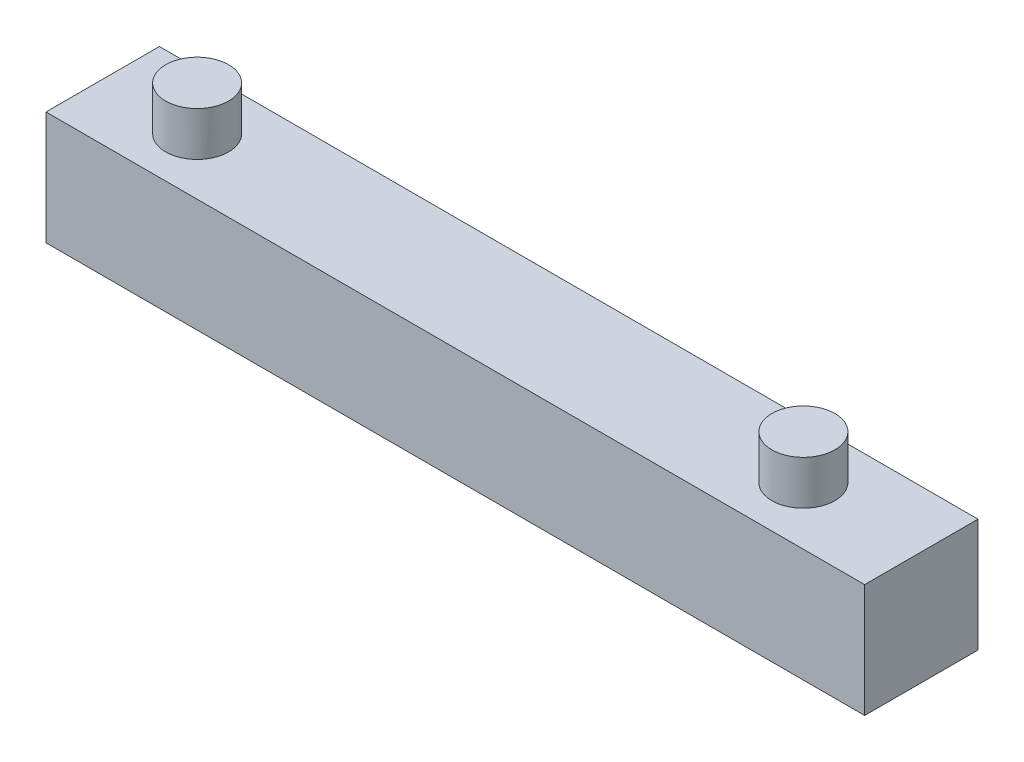
ISO-10303-21;
HEADER;
FILE_DESCRIPTION(('STEP AP214'),'2;1');
FILE_NAME('part.step','',(''),(''),'','','');
FILE_SCHEMA(('AUTOMOTIVE_DESIGN { 1 0 10303 214 1 1 1 1 }'));
ENDSEC;
DATA;
#1=APPLICATION_CONTEXT('core data for automotive mechanical design processes');
#2=APPLICATION_PROTOCOL_DEFINITION('international standard','automotive_design',2000,#1);
#3=PRODUCT_CONTEXT('',#1,'mechanical');
#4=PRODUCT('Part','Part','',(#3));
#5=PRODUCT_RELATED_PRODUCT_CATEGORY('part','',(#4));
#6=PRODUCT_DEFINITION_FORMATION('','',#4);
#7=PRODUCT_DEFINITION_CONTEXT('part definition',#1,'design');
#8=PRODUCT_DEFINITION('design','',#6,#7);
#9=PRODUCT_DEFINITION_SHAPE('','',#8);
#10=(LENGTH_UNIT() NAMED_UNIT(*) SI_UNIT(.MILLI.,.METRE.));
#11=(NAMED_UNIT(*) PLANE_ANGLE_UNIT() SI_UNIT($,.RADIAN.));
#12=(NAMED_UNIT(*) SI_UNIT($,.STERADIAN.) SOLID_ANGLE_UNIT());
#13=UNCERTAINTY_MEASURE_WITH_UNIT(LENGTH_MEASURE(1.E-05),#10,'distance_accuracy_value','');
#14=(GEOMETRIC_REPRESENTATION_CONTEXT(3) GLOBAL_UNCERTAINTY_ASSIGNED_CONTEXT((#13)) GLOBAL_UNIT_ASSIGNED_CONTEXT((#10,
#11,#12)) REPRESENTATION_CONTEXT('',''));
#15=CARTESIAN_POINT('',(0.,0.,0.));
#16=DIRECTION('',(0.,0.,1.));
#17=DIRECTION('',(1.,0.,0.));
#18=AXIS2_PLACEMENT_3D('',#15,#16,#17);
#19=CARTESIAN_POINT('',(0.,9.,9.));
#20=DIRECTION('',(0.,-1.,0.));
#21=DIRECTION('',(0.,0.,-1.));
#22=AXIS2_PLACEMENT_3D('',#19,#20,#21);
#23=PLANE('',#22);
#24=CARTESIAN_POINT('',(7.5,9.,4.5));
#25=DIRECTION('',(0.,-1.,0.));
#26=DIRECTION('',(0.,0.,-1.));
#27=AXIS2_PLACEMENT_3D('',#24,#25,#26);
#28=CIRCLE('',#27,2.5);
#29=CARTESIAN_POINT('',(7.5,9.,2.));
#30=VERTEX_POINT('',#29);
#31=EDGE_CURVE('E42',#30,#30,#28,.F.);
#32=ORIENTED_EDGE('',*,*,#31,.F.);
#33=EDGE_LOOP('',(#32));
#34=FACE_BOUND('',#33,.T.);
#35=DIRECTION('',(-1.,0.,0.));
#36=VECTOR('',#35,1.);
#37=CARTESIAN_POINT('',(0.,9.,0.));
#38=LINE('',#37,#36);
#39=CARTESIAN_POINT('',(65.,9.,0.));
#40=VERTEX_POINT('',#39);
#41=CARTESIAN_POINT('',(0.,9.,0.));
#42=VERTEX_POINT('',#41);
#43=EDGE_CURVE('E73',#40,#42,#38,.T.);
#44=ORIENTED_EDGE('',*,*,#43,.T.);
#45=DIRECTION('',(0.,0.,-1.));
#46=VECTOR('',#45,1.);
#47=CARTESIAN_POINT('',(0.,9.,9.));
#48=LINE('',#47,#46);
#49=CARTESIAN_POINT('',(0.,9.,9.));
#50=VERTEX_POINT('',#49);
#51=EDGE_CURVE('E97',#50,#42,#48,.T.);
#52=ORIENTED_EDGE('',*,*,#51,.F.);
#53=DIRECTION('',(-1.,0.,0.));
#54=VECTOR('',#53,1.);
#55=CARTESIAN_POINT('',(0.,9.,9.));
#56=LINE('',#55,#54);
#57=CARTESIAN_POINT('',(65.,9.,9.));
#58=VERTEX_POINT('',#57);
#59=EDGE_CURVE('E50',#58,#50,#56,.T.);
#60=ORIENTED_EDGE('',*,*,#59,.F.);
#61=DIRECTION('',(0.,0.,-1.));
#62=VECTOR('',#61,1.);
#63=CARTESIAN_POINT('',(65.,9.,9.));
#64=LINE('',#63,#62);
#65=EDGE_CURVE('E93',#58,#40,#64,.T.);
#66=ORIENTED_EDGE('',*,*,#65,.T.);
#67=EDGE_LOOP('',(#44,#52,#60,#66));
#68=FACE_BOUND('',#67,.T.);
#69=CARTESIAN_POINT('',(55.5492258402168,9.,4.41399542596931));
#70=DIRECTION('',(0.,-1.,0.));
#71=DIRECTION('',(0.,0.,-1.));
#72=AXIS2_PLACEMENT_3D('',#69,#70,#71);
#73=CIRCLE('',#72,2.5);
#74=CARTESIAN_POINT('',(55.5492258402168,9.,1.91399542596931));
#75=VERTEX_POINT('',#74);
#76=EDGE_CURVE('E11',#75,#75,#73,.F.);
#77=ORIENTED_EDGE('',*,*,#76,.F.);
#78=EDGE_LOOP('',(#77));
#79=FACE_BOUND('',#78,.T.);
#80=ADVANCED_FACE('F33',(#34,#68,#79),#23,.F.);
#81=CARTESIAN_POINT('',(0.,0.,9.));
#82=DIRECTION('',(1.,0.,0.));
#83=DIRECTION('',(0.,0.,-1.));
#84=AXIS2_PLACEMENT_3D('',#81,#82,#83);
#85=PLANE('',#84);
#86=DIRECTION('',(0.,-1.,0.));
#87=VECTOR('',#86,1.);
#88=CARTESIAN_POINT('',(0.,0.,0.));
#89=LINE('',#88,#87);
#90=CARTESIAN_POINT('',(0.,0.,0.));
#91=VERTEX_POINT('',#90);
#92=EDGE_CURVE('E101',#42,#91,#89,.T.);
#93=ORIENTED_EDGE('',*,*,#92,.T.);
#94=DIRECTION('',(0.,0.,-1.));
#95=VECTOR('',#94,1.);
#96=CARTESIAN_POINT('',(0.,0.,9.));
#97=LINE('',#96,#95);
#98=CARTESIAN_POINT('',(0.,0.,9.));
#99=VERTEX_POINT('',#98);
#100=EDGE_CURVE('E92',#99,#91,#97,.T.);
#101=ORIENTED_EDGE('',*,*,#100,.F.);
#102=DIRECTION('',(0.,-1.,0.));
#103=VECTOR('',#102,1.);
#104=CARTESIAN_POINT('',(0.,0.,9.));
#105=LINE('',#104,#103);
#106=EDGE_CURVE('E86',#50,#99,#105,.T.);
#107=ORIENTED_EDGE('',*,*,#106,.F.);
#108=ORIENTED_EDGE('',*,*,#51,.T.);
#109=EDGE_LOOP('',(#93,#101,#107,#108));
#110=FACE_BOUND('',#109,.T.);
#111=ADVANCED_FACE('F35',(#110),#85,.F.);
#112=CARTESIAN_POINT('',(0.,0.,9.));
#113=DIRECTION('',(0.,1.,0.));
#114=DIRECTION('',(0.,0.,1.));
#115=AXIS2_PLACEMENT_3D('',#112,#113,#114);
#116=PLANE('',#115);
#117=DIRECTION('',(1.,0.,0.));
#118=VECTOR('',#117,1.);
#119=CARTESIAN_POINT('',(0.,0.,0.));
#120=LINE('',#119,#118);
#121=CARTESIAN_POINT('',(65.,0.,0.));
#122=VERTEX_POINT('',#121);
#123=EDGE_CURVE('E91',#91,#122,#120,.T.);
#124=ORIENTED_EDGE('',*,*,#123,.T.);
#125=DIRECTION('',(0.,0.,-1.));
#126=VECTOR('',#125,1.);
#127=CARTESIAN_POINT('',(65.,0.,9.));
#128=LINE('',#127,#126);
#129=CARTESIAN_POINT('',(65.,0.,9.));
#130=VERTEX_POINT('',#129);
#131=EDGE_CURVE('E89',#130,#122,#128,.T.);
#132=ORIENTED_EDGE('',*,*,#131,.F.);
#133=DIRECTION('',(1.,0.,0.));
#134=VECTOR('',#133,1.);
#135=CARTESIAN_POINT('',(0.,0.,9.));
#136=LINE('',#135,#134);
#137=EDGE_CURVE('E81',#99,#130,#136,.T.);
#138=ORIENTED_EDGE('',*,*,#137,.F.);
#139=ORIENTED_EDGE('',*,*,#100,.T.);
#140=EDGE_LOOP('',(#124,#132,#138,#139));
#141=FACE_BOUND('',#140,.T.);
#142=ADVANCED_FACE('F90',(#141),#116,.F.);
#143=CARTESIAN_POINT('',(65.,0.,9.));
#144=DIRECTION('',(-1.,0.,0.));
#145=DIRECTION('',(0.,0.,1.));
#146=AXIS2_PLACEMENT_3D('',#143,#144,#145);
#147=PLANE('',#146);
#148=DIRECTION('',(0.,1.,0.));
#149=VECTOR('',#148,1.);
#150=CARTESIAN_POINT('',(65.,0.,0.));
#151=LINE('',#150,#149);
#152=EDGE_CURVE('E67',#122,#40,#151,.T.);
#153=ORIENTED_EDGE('',*,*,#152,.T.);
#154=ORIENTED_EDGE('',*,*,#65,.F.);
#155=DIRECTION('',(0.,1.,0.));
#156=VECTOR('',#155,1.);
#157=CARTESIAN_POINT('',(65.,0.,9.));
#158=LINE('',#157,#156);
#159=EDGE_CURVE('E84',#130,#58,#158,.T.);
#160=ORIENTED_EDGE('',*,*,#159,.F.);
#161=ORIENTED_EDGE('',*,*,#131,.T.);
#162=EDGE_LOOP('',(#153,#154,#160,#161));
#163=FACE_BOUND('',#162,.T.);
#164=ADVANCED_FACE('F95',(#163),#147,.F.);
#165=CARTESIAN_POINT('',(0.,0.,9.));
#166=DIRECTION('',(0.,0.,-1.));
#167=DIRECTION('',(-1.,0.,0.));
#168=AXIS2_PLACEMENT_3D('',#165,#166,#167);
#169=PLANE('',#168);
#170=ORIENTED_EDGE('',*,*,#106,.T.);
#171=ORIENTED_EDGE('',*,*,#137,.T.);
#172=ORIENTED_EDGE('',*,*,#159,.T.);
#173=ORIENTED_EDGE('',*,*,#59,.T.);
#174=EDGE_LOOP('',(#170,#171,#172,#173));
#175=FACE_BOUND('',#174,.T.);
#176=ADVANCED_FACE('F82',(#175),#169,.F.);
#177=CARTESIAN_POINT('',(0.,0.,0.));
#178=DIRECTION('',(0.,0.,-1.));
#179=DIRECTION('',(-1.,0.,0.));
#180=AXIS2_PLACEMENT_3D('',#177,#178,#179);
#181=PLANE('',#180);
#182=ORIENTED_EDGE('',*,*,#92,.F.);
#183=ORIENTED_EDGE('',*,*,#43,.F.);
#184=ORIENTED_EDGE('',*,*,#152,.F.);
#185=ORIENTED_EDGE('',*,*,#123,.F.);
#186=EDGE_LOOP('',(#182,#183,#184,#185));
#187=FACE_BOUND('',#186,.T.);
#188=ADVANCED_FACE('F138',(#187),#181,.T.);
#189=CARTESIAN_POINT('',(7.5,12.5,4.5));
#190=DIRECTION('',(0.,-1.,0.));
#191=DIRECTION('',(0.,0.,-1.));
#192=AXIS2_PLACEMENT_3D('',#189,#190,#191);
#193=CYLINDRICAL_SURFACE('',#192,2.5);
#194=CARTESIAN_POINT('',(7.5,12.5,4.5));
#195=DIRECTION('',(0.,1.,0.));
#196=DIRECTION('',(0.,0.,1.));
#197=AXIS2_PLACEMENT_3D('',#194,#195,#196);
#198=CIRCLE('',#197,2.5);
#199=CARTESIAN_POINT('',(7.5,12.5,7.));
#200=VERTEX_POINT('',#199);
#201=EDGE_CURVE('E104',#200,#200,#198,.T.);
#202=ORIENTED_EDGE('',*,*,#201,.F.);
#203=EDGE_LOOP('',(#202));
#204=FACE_BOUND('',#203,.T.);
#205=ORIENTED_EDGE('',*,*,#31,.T.);
#206=EDGE_LOOP('',(#205));
#207=FACE_BOUND('',#206,.T.);
#208=ADVANCED_FACE('F113',(#204,#207),#193,.T.);
#209=CARTESIAN_POINT('',(7.5,12.5,4.5));
#210=DIRECTION('',(0.,1.,0.));
#211=DIRECTION('',(0.,0.,1.));
#212=AXIS2_PLACEMENT_3D('',#209,#210,#211);
#213=PLANE('',#212);
#214=ORIENTED_EDGE('',*,*,#201,.T.);
#215=EDGE_LOOP('',(#214));
#216=FACE_BOUND('',#215,.T.);
#217=ADVANCED_FACE('F123',(#216),#213,.T.);
#218=CARTESIAN_POINT('',(55.5492258402168,12.5,4.41399542596931));
#219=DIRECTION('',(0.,-1.,0.));
#220=DIRECTION('',(0.,0.,-1.));
#221=AXIS2_PLACEMENT_3D('',#218,#219,#220);
#222=CYLINDRICAL_SURFACE('',#221,2.5);
#223=CARTESIAN_POINT('',(55.5492258402168,12.5,4.41399542596931));
#224=DIRECTION('',(0.,1.,0.));
#225=DIRECTION('',(0.,0.,1.));
#226=AXIS2_PLACEMENT_3D('',#223,#224,#225);
#227=CIRCLE('',#226,2.5);
#228=CARTESIAN_POINT('',(55.5492258402168,12.5,6.91399542596931));
#229=VERTEX_POINT('',#228);
#230=EDGE_CURVE('E157',#229,#229,#227,.T.);
#231=ORIENTED_EDGE('',*,*,#230,.F.);
#232=EDGE_LOOP('',(#231));
#233=FACE_BOUND('',#232,.T.);
#234=ORIENTED_EDGE('',*,*,#76,.T.);
#235=EDGE_LOOP('',(#234));
#236=FACE_BOUND('',#235,.T.);
#237=ADVANCED_FACE('F120',(#233,#236),#222,.T.);
#238=CARTESIAN_POINT('',(55.5492258402168,12.5,4.41399542596931));
#239=DIRECTION('',(0.,1.,0.));
#240=DIRECTION('',(0.,0.,1.));
#241=AXIS2_PLACEMENT_3D('',#238,#239,#240);
#242=PLANE('',#241);
#243=ORIENTED_EDGE('',*,*,#230,.T.);
#244=EDGE_LOOP('',(#243));
#245=FACE_BOUND('',#244,.T.);
#246=ADVANCED_FACE('F122',(#245),#242,.T.);
#247=CLOSED_SHELL('',(#80,#111,#142,#164,#176,#188,#208,#217,#237,#246));
#248=MANIFOLD_SOLID_BREP('B2',#247);
#249=ADVANCED_BREP_SHAPE_REPRESENTATION('',(#18,#248),#14);
#250=SHAPE_DEFINITION_REPRESENTATION(#9,#249);
ENDSEC;
END-ISO-10303-21;
